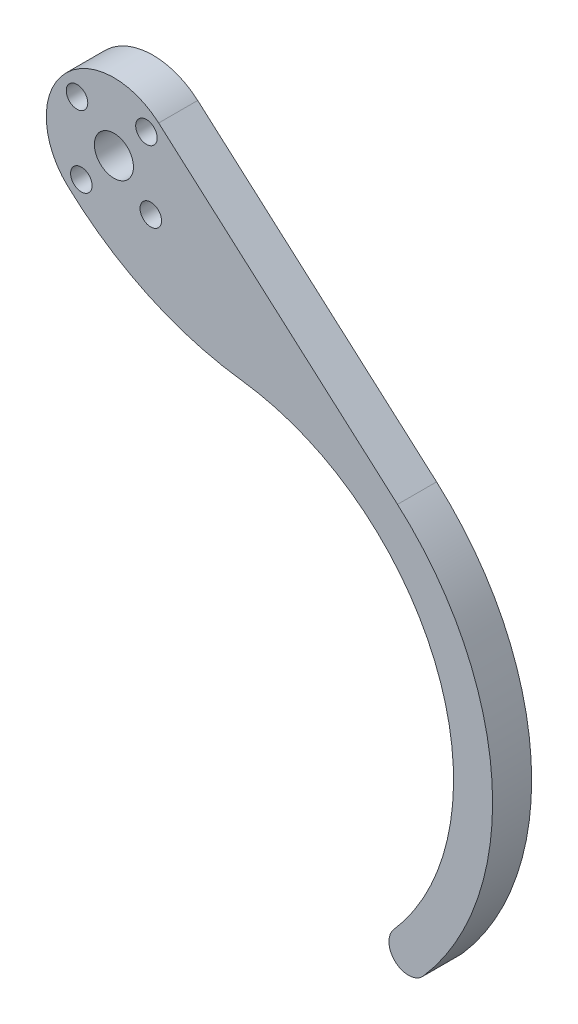
ISO-10303-21;
HEADER;
FILE_DESCRIPTION(('STEP AP214'),'2;1');
FILE_NAME('part.step','',(''),(''),'','','');
FILE_SCHEMA(('AUTOMOTIVE_DESIGN { 1 0 10303 214 1 1 1 1 }'));
ENDSEC;
DATA;
#1=APPLICATION_CONTEXT('core data for automotive mechanical design processes');
#2=APPLICATION_PROTOCOL_DEFINITION('international standard','automotive_design',2000,#1);
#3=PRODUCT_CONTEXT('',#1,'mechanical');
#4=PRODUCT('Part','Part','',(#3));
#5=PRODUCT_RELATED_PRODUCT_CATEGORY('part','',(#4));
#6=PRODUCT_DEFINITION_FORMATION('','',#4);
#7=PRODUCT_DEFINITION_CONTEXT('part definition',#1,'design');
#8=PRODUCT_DEFINITION('design','',#6,#7);
#9=PRODUCT_DEFINITION_SHAPE('','',#8);
#10=(LENGTH_UNIT() NAMED_UNIT(*) SI_UNIT(.MILLI.,.METRE.));
#11=(NAMED_UNIT(*) PLANE_ANGLE_UNIT() SI_UNIT($,.RADIAN.));
#12=(NAMED_UNIT(*) SI_UNIT($,.STERADIAN.) SOLID_ANGLE_UNIT());
#13=UNCERTAINTY_MEASURE_WITH_UNIT(LENGTH_MEASURE(1.E-05),#10,'distance_accuracy_value','');
#14=(GEOMETRIC_REPRESENTATION_CONTEXT(3) GLOBAL_UNCERTAINTY_ASSIGNED_CONTEXT((#13)) GLOBAL_UNIT_ASSIGNED_CONTEXT((#10,
#11,#12)) REPRESENTATION_CONTEXT('',''));
#15=CARTESIAN_POINT('',(0.,0.,0.));
#16=DIRECTION('',(0.,0.,1.));
#17=DIRECTION('',(1.,0.,0.));
#18=AXIS2_PLACEMENT_3D('',#15,#16,#17);
#19=CARTESIAN_POINT('',(11.2309982796719,89.467835436217,6.35));
#20=DIRECTION('',(0.,0.,-1.));
#21=DIRECTION('',(-1.,0.,0.));
#22=AXIS2_PLACEMENT_3D('',#19,#20,#21);
#23=CYLINDRICAL_SURFACE('',#22,50.8);
#24=CARTESIAN_POINT('',(11.2309982796719,89.467835436217,0.));
#25=DIRECTION('',(0.,0.,1.));
#26=DIRECTION('',(1.,0.,0.));
#27=AXIS2_PLACEMENT_3D('',#24,#25,#26);
#28=CIRCLE('',#27,50.8);
#29=CARTESIAN_POINT('',(-23.3666075647334,52.2704474925029,0.));
#30=VERTEX_POINT('',#29);
#31=CARTESIAN_POINT('',(4.90367530520884,39.0634211059539,0.));
#32=VERTEX_POINT('',#31);
#33=EDGE_CURVE('E116',#30,#32,#28,.T.);
#34=ORIENTED_EDGE('',*,*,#33,.T.);
#35=DIRECTION('',(0.,0.,-1.));
#36=VECTOR('',#35,1.);
#37=CARTESIAN_POINT('',(4.90367530520884,39.0634211059539,6.35));
#38=LINE('',#37,#36);
#39=CARTESIAN_POINT('',(4.90367530520884,39.0634211059539,6.35));
#40=VERTEX_POINT('',#39);
#41=EDGE_CURVE('E11',#40,#32,#38,.T.);
#42=ORIENTED_EDGE('',*,*,#41,.F.);
#43=CARTESIAN_POINT('',(11.2309982796719,89.467835436217,6.35));
#44=DIRECTION('',(0.,0.,1.));
#45=DIRECTION('',(1.,0.,0.));
#46=AXIS2_PLACEMENT_3D('',#43,#44,#45);
#47=CIRCLE('',#46,50.8);
#48=CARTESIAN_POINT('',(-23.3666075647334,52.2704474925029,6.35));
#49=VERTEX_POINT('',#48);
#50=EDGE_CURVE('E127',#49,#40,#47,.T.);
#51=ORIENTED_EDGE('',*,*,#50,.F.);
#52=DIRECTION('',(0.,0.,-1.));
#53=VECTOR('',#52,1.);
#54=CARTESIAN_POINT('',(-23.3666075647334,52.2704474925029,6.35));
#55=LINE('',#54,#53);
#56=EDGE_CURVE('E112',#49,#30,#55,.T.);
#57=ORIENTED_EDGE('',*,*,#56,.T.);
#58=EDGE_LOOP('',(#34,#42,#51,#57));
#59=FACE_BOUND('',#58,.T.);
#60=ADVANCED_FACE('F32',(#59),#23,.T.);
#61=CARTESIAN_POINT('',(0.,0.,6.35));
#62=DIRECTION('',(0.,0.,-1.));
#63=DIRECTION('',(-1.,0.,0.));
#64=AXIS2_PLACEMENT_3D('',#61,#62,#63);
#65=CYLINDRICAL_SURFACE('',#64,39.37);
#66=CARTESIAN_POINT('',(0.,0.,0.));
#67=DIRECTION('',(0.,0.,-1.));
#68=DIRECTION('',(1.,0.,0.));
#69=AXIS2_PLACEMENT_3D('',#66,#67,#68);
#70=CIRCLE('',#69,39.37);
#71=CARTESIAN_POINT('',(29.6456856377598,-25.9061811749073,0.));
#72=VERTEX_POINT('',#71);
#73=EDGE_CURVE('E119',#32,#72,#70,.T.);
#74=ORIENTED_EDGE('',*,*,#73,.T.);
#75=DIRECTION('',(0.,0.,-1.));
#76=VECTOR('',#75,1.);
#77=CARTESIAN_POINT('',(29.6456856377598,-25.9061811749073,6.35));
#78=LINE('',#77,#76);
#79=CARTESIAN_POINT('',(29.6456856377598,-25.9061811749073,6.35));
#80=VERTEX_POINT('',#79);
#81=EDGE_CURVE('E40',#80,#72,#78,.T.);
#82=ORIENTED_EDGE('',*,*,#81,.F.);
#83=CARTESIAN_POINT('',(0.,0.,6.35));
#84=DIRECTION('',(0.,0.,-1.));
#85=DIRECTION('',(1.,0.,0.));
#86=AXIS2_PLACEMENT_3D('',#83,#84,#85);
#87=CIRCLE('',#86,39.37);
#88=EDGE_CURVE('E85',#40,#80,#87,.T.);
#89=ORIENTED_EDGE('',*,*,#88,.F.);
#90=ORIENTED_EDGE('',*,*,#41,.T.);
#91=EDGE_LOOP('',(#74,#82,#89,#90));
#92=FACE_BOUND('',#91,.T.);
#93=ADVANCED_FACE('F152',(#92),#65,.F.);
#94=CARTESIAN_POINT('',(32.0364667375792,-27.995389334174,6.35));
#95=DIRECTION('',(0.,0.,-1.));
#96=DIRECTION('',(-1.,0.,0.));
#97=AXIS2_PLACEMENT_3D('',#94,#95,#96);
#98=CYLINDRICAL_SURFACE('',#97,3.175);
#99=CARTESIAN_POINT('',(32.0364667375792,-27.995389334174,0.));
#100=DIRECTION('',(0.,0.,1.));
#101=DIRECTION('',(1.,0.,0.));
#102=AXIS2_PLACEMENT_3D('',#99,#100,#101);
#103=CIRCLE('',#102,3.175);
#104=CARTESIAN_POINT('',(34.4272478373985,-30.0845974934407,0.));
#105=VERTEX_POINT('',#104);
#106=EDGE_CURVE('E122',#72,#105,#103,.T.);
#107=ORIENTED_EDGE('',*,*,#106,.T.);
#108=DIRECTION('',(0.,0.,-1.));
#109=VECTOR('',#108,1.);
#110=CARTESIAN_POINT('',(34.4272478373985,-30.0845974934407,6.35));
#111=LINE('',#110,#109);
#112=CARTESIAN_POINT('',(34.4272478373985,-30.0845974934407,6.35));
#113=VERTEX_POINT('',#112);
#114=EDGE_CURVE('E107',#113,#105,#111,.T.);
#115=ORIENTED_EDGE('',*,*,#114,.F.);
#116=CARTESIAN_POINT('',(32.0364667375792,-27.995389334174,6.35));
#117=DIRECTION('',(0.,0.,1.));
#118=DIRECTION('',(1.,0.,0.));
#119=AXIS2_PLACEMENT_3D('',#116,#117,#118);
#120=CIRCLE('',#119,3.175);
#121=EDGE_CURVE('E98',#80,#113,#120,.T.);
#122=ORIENTED_EDGE('',*,*,#121,.F.);
#123=ORIENTED_EDGE('',*,*,#81,.T.);
#124=EDGE_LOOP('',(#107,#115,#122,#123));
#125=FACE_BOUND('',#124,.T.);
#126=ADVANCED_FACE('F133',(#125),#98,.T.);
#127=CARTESIAN_POINT('',(0.,0.,6.35));
#128=DIRECTION('',(0.,0.,-1.));
#129=DIRECTION('',(-1.,0.,0.));
#130=AXIS2_PLACEMENT_3D('',#127,#128,#129);
#131=CYLINDRICAL_SURFACE('',#130,45.72);
#132=CARTESIAN_POINT('',(0.,0.,0.));
#133=DIRECTION('',(0.,0.,1.));
#134=DIRECTION('',(1.,0.,0.));
#135=AXIS2_PLACEMENT_3D('',#132,#133,#134);
#136=CIRCLE('',#135,45.72);
#137=CARTESIAN_POINT('',(30.2564360895205,34.2763252867159,0.));
#138=VERTEX_POINT('',#137);
#139=EDGE_CURVE('E106',#105,#138,#136,.T.);
#140=ORIENTED_EDGE('',*,*,#139,.T.);
#141=DIRECTION('',(0.,0.,-1.));
#142=VECTOR('',#141,1.);
#143=CARTESIAN_POINT('',(30.2564360895205,34.2763252867159,6.35));
#144=LINE('',#143,#142);
#145=CARTESIAN_POINT('',(30.2564360895205,34.2763252867159,6.35));
#146=VERTEX_POINT('',#145);
#147=EDGE_CURVE('E103',#146,#138,#144,.T.);
#148=ORIENTED_EDGE('',*,*,#147,.F.);
#149=CARTESIAN_POINT('',(0.,0.,6.35));
#150=DIRECTION('',(0.,0.,1.));
#151=DIRECTION('',(1.,0.,0.));
#152=AXIS2_PLACEMENT_3D('',#149,#150,#151);
#153=CIRCLE('',#152,45.72);
#154=EDGE_CURVE('E92',#113,#146,#153,.T.);
#155=ORIENTED_EDGE('',*,*,#154,.F.);
#156=ORIENTED_EDGE('',*,*,#114,.T.);
#157=EDGE_LOOP('',(#140,#148,#155,#156));
#158=FACE_BOUND('',#157,.T.);
#159=ADVANCED_FACE('F104',(#158),#131,.T.);
#160=CARTESIAN_POINT('',(-8.59545500908298,68.5717099333744,6.35));
#161=DIRECTION('',(-0.661776817356092,-0.749700903034031,0.));
#162=DIRECTION('',(0.749700903034031,-0.661776817356092,0.));
#163=AXIS2_PLACEMENT_3D('',#160,#161,#162);
#164=PLANE('',#163);
#165=DIRECTION('',(-0.749700903034031,0.661776817356092,0.));
#166=VECTOR('',#165,1.);
#167=CARTESIAN_POINT('',(-8.59545500908298,68.5717099333744,0.));
#168=LINE('',#167,#166);
#169=CARTESIAN_POINT('',(-8.59545500908298,68.5717099333744,0.));
#170=VERTEX_POINT('',#169);
#171=EDGE_CURVE('E71',#138,#170,#168,.T.);
#172=ORIENTED_EDGE('',*,*,#171,.T.);
#173=DIRECTION('',(0.,0.,-1.));
#174=VECTOR('',#173,1.);
#175=CARTESIAN_POINT('',(-8.59545500908298,68.5717099333744,6.35));
#176=LINE('',#175,#174);
#177=CARTESIAN_POINT('',(-8.59545500908298,68.5717099333744,6.35));
#178=VERTEX_POINT('',#177);
#179=EDGE_CURVE('E108',#178,#170,#176,.T.);
#180=ORIENTED_EDGE('',*,*,#179,.F.);
#181=DIRECTION('',(-0.749700903034031,0.661776817356092,0.));
#182=VECTOR('',#181,1.);
#183=CARTESIAN_POINT('',(-8.59545500908298,68.5717099333744,6.35));
#184=LINE('',#183,#182);
#185=EDGE_CURVE('E96',#146,#178,#184,.T.);
#186=ORIENTED_EDGE('',*,*,#185,.F.);
#187=ORIENTED_EDGE('',*,*,#147,.T.);
#188=EDGE_LOOP('',(#172,#180,#186,#187));
#189=FACE_BOUND('',#188,.T.);
#190=ADVANCED_FACE('F110',(#189),#164,.F.);
#191=CARTESIAN_POINT('',(-15.875,60.325,6.35));
#192=DIRECTION('',(0.,0.,-1.));
#193=DIRECTION('',(-1.,0.,0.));
#194=AXIS2_PLACEMENT_3D('',#191,#192,#193);
#195=CYLINDRICAL_SURFACE('',#194,11.);
#196=CARTESIAN_POINT('',(-15.875,60.325,0.));
#197=DIRECTION('',(0.,0.,1.));
#198=DIRECTION('',(-1.,0.,0.));
#199=AXIS2_PLACEMENT_3D('',#196,#197,#198);
#200=CIRCLE('',#199,11.);
#201=EDGE_CURVE('E77',#170,#30,#200,.T.);
#202=ORIENTED_EDGE('',*,*,#201,.T.);
#203=ORIENTED_EDGE('',*,*,#56,.F.);
#204=CARTESIAN_POINT('',(-15.875,60.325,6.35));
#205=DIRECTION('',(0.,0.,1.));
#206=DIRECTION('',(-1.,0.,0.));
#207=AXIS2_PLACEMENT_3D('',#204,#205,#206);
#208=CIRCLE('',#207,11.);
#209=EDGE_CURVE('E48',#178,#49,#208,.T.);
#210=ORIENTED_EDGE('',*,*,#209,.F.);
#211=ORIENTED_EDGE('',*,*,#179,.T.);
#212=EDGE_LOOP('',(#202,#203,#210,#211));
#213=FACE_BOUND('',#212,.T.);
#214=ADVANCED_FACE('F140',(#213),#195,.T.);
#215=CARTESIAN_POINT('',(11.2309982796719,89.467835436217,6.35));
#216=DIRECTION('',(0.,0.,1.));
#217=DIRECTION('',(1.,0.,0.));
#218=AXIS2_PLACEMENT_3D('',#215,#216,#217);
#219=PLANE('',#218);
#220=CARTESIAN_POINT('',(-21.8726072242722,65.6192145388485,6.35));
#221=DIRECTION('',(0.,0.,1.));
#222=DIRECTION('',(1.,0.,0.));
#223=AXIS2_PLACEMENT_3D('',#220,#221,#222);
#224=CIRCLE('',#223,1.75000000000001);
#225=CARTESIAN_POINT('',(-20.1226072242722,65.6192145388485,6.35));
#226=VERTEX_POINT('',#225);
#227=EDGE_CURVE('E248',#226,#226,#224,.T.);
#228=ORIENTED_EDGE('',*,*,#227,.F.);
#229=EDGE_LOOP('',(#228));
#230=FACE_BOUND('',#229,.T.);
#231=CARTESIAN_POINT('',(-21.1692145388484,54.3273927757275,6.35));
#232=DIRECTION('',(0.,0.,1.));
#233=DIRECTION('',(1.,0.,0.));
#234=AXIS2_PLACEMENT_3D('',#231,#232,#233);
#235=CIRCLE('',#234,1.75);
#236=CARTESIAN_POINT('',(-19.4192145388484,54.3273927757275,6.35));
#237=VERTEX_POINT('',#236);
#238=EDGE_CURVE('E250',#237,#237,#235,.T.);
#239=ORIENTED_EDGE('',*,*,#238,.F.);
#240=EDGE_LOOP('',(#239));
#241=FACE_BOUND('',#240,.T.);
#242=CARTESIAN_POINT('',(-9.87739277572743,55.0307854611513,6.35));
#243=DIRECTION('',(0.,0.,1.));
#244=DIRECTION('',(1.,0.,0.));
#245=AXIS2_PLACEMENT_3D('',#242,#243,#244);
#246=CIRCLE('',#245,1.75);
#247=CARTESIAN_POINT('',(-8.12739277572743,55.0307854611513,6.35));
#248=VERTEX_POINT('',#247);
#249=EDGE_CURVE('E256',#248,#248,#246,.T.);
#250=ORIENTED_EDGE('',*,*,#249,.F.);
#251=EDGE_LOOP('',(#250));
#252=FACE_BOUND('',#251,.T.);
#253=CARTESIAN_POINT('',(-10.5807854611513,66.3226072242723,6.35));
#254=DIRECTION('',(0.,0.,1.));
#255=DIRECTION('',(1.,0.,0.));
#256=AXIS2_PLACEMENT_3D('',#253,#254,#255);
#257=CIRCLE('',#256,1.75);
#258=CARTESIAN_POINT('',(-8.83078546115125,66.3226072242723,6.35));
#259=VERTEX_POINT('',#258);
#260=EDGE_CURVE('E262',#259,#259,#257,.T.);
#261=ORIENTED_EDGE('',*,*,#260,.F.);
#262=EDGE_LOOP('',(#261));
#263=FACE_BOUND('',#262,.T.);
#264=CARTESIAN_POINT('',(-15.875,60.325,6.35));
#265=DIRECTION('',(0.,0.,1.));
#266=DIRECTION('',(1.,0.,0.));
#267=AXIS2_PLACEMENT_3D('',#264,#265,#266);
#268=CIRCLE('',#267,3.175);
#269=CARTESIAN_POINT('',(-12.7,60.325,6.35));
#270=VERTEX_POINT('',#269);
#271=EDGE_CURVE('E268',#270,#270,#268,.T.);
#272=ORIENTED_EDGE('',*,*,#271,.F.);
#273=EDGE_LOOP('',(#272));
#274=FACE_BOUND('',#273,.T.);
#275=ORIENTED_EDGE('',*,*,#50,.T.);
#276=ORIENTED_EDGE('',*,*,#88,.T.);
#277=ORIENTED_EDGE('',*,*,#121,.T.);
#278=ORIENTED_EDGE('',*,*,#154,.T.);
#279=ORIENTED_EDGE('',*,*,#185,.T.);
#280=ORIENTED_EDGE('',*,*,#209,.T.);
#281=EDGE_LOOP('',(#275,#276,#277,#278,#279,#280));
#282=FACE_BOUND('',#281,.T.);
#283=ADVANCED_FACE('F94',(#230,#241,#252,#263,#274,#282),#219,.T.);
#284=CARTESIAN_POINT('',(11.2309982796719,89.467835436217,0.));
#285=DIRECTION('',(0.,0.,1.));
#286=DIRECTION('',(1.,0.,0.));
#287=AXIS2_PLACEMENT_3D('',#284,#285,#286);
#288=PLANE('',#287);
#289=CARTESIAN_POINT('',(-21.8726072242722,65.6192145388485,0.));
#290=DIRECTION('',(0.,0.,1.));
#291=DIRECTION('',(1.,0.,0.));
#292=AXIS2_PLACEMENT_3D('',#289,#290,#291);
#293=CIRCLE('',#292,1.75000000000001);
#294=CARTESIAN_POINT('',(-20.1226072242722,65.6192145388485,0.));
#295=VERTEX_POINT('',#294);
#296=EDGE_CURVE('E245',#295,#295,#293,.T.);
#297=ORIENTED_EDGE('',*,*,#296,.T.);
#298=EDGE_LOOP('',(#297));
#299=FACE_BOUND('',#298,.T.);
#300=CARTESIAN_POINT('',(-21.1692145388484,54.3273927757275,0.));
#301=DIRECTION('',(0.,0.,1.));
#302=DIRECTION('',(1.,0.,0.));
#303=AXIS2_PLACEMENT_3D('',#300,#301,#302);
#304=CIRCLE('',#303,1.75);
#305=CARTESIAN_POINT('',(-19.4192145388484,54.3273927757275,0.));
#306=VERTEX_POINT('',#305);
#307=EDGE_CURVE('E253',#306,#306,#304,.T.);
#308=ORIENTED_EDGE('',*,*,#307,.T.);
#309=EDGE_LOOP('',(#308));
#310=FACE_BOUND('',#309,.T.);
#311=CARTESIAN_POINT('',(-9.87739277572743,55.0307854611513,0.));
#312=DIRECTION('',(0.,0.,1.));
#313=DIRECTION('',(1.,0.,0.));
#314=AXIS2_PLACEMENT_3D('',#311,#312,#313);
#315=CIRCLE('',#314,1.75);
#316=CARTESIAN_POINT('',(-8.12739277572743,55.0307854611513,0.));
#317=VERTEX_POINT('',#316);
#318=EDGE_CURVE('E259',#317,#317,#315,.T.);
#319=ORIENTED_EDGE('',*,*,#318,.T.);
#320=EDGE_LOOP('',(#319));
#321=FACE_BOUND('',#320,.T.);
#322=CARTESIAN_POINT('',(-10.5807854611513,66.3226072242723,0.));
#323=DIRECTION('',(0.,0.,1.));
#324=DIRECTION('',(1.,0.,0.));
#325=AXIS2_PLACEMENT_3D('',#322,#323,#324);
#326=CIRCLE('',#325,1.75);
#327=CARTESIAN_POINT('',(-8.83078546115125,66.3226072242723,0.));
#328=VERTEX_POINT('',#327);
#329=EDGE_CURVE('E265',#328,#328,#326,.T.);
#330=ORIENTED_EDGE('',*,*,#329,.T.);
#331=EDGE_LOOP('',(#330));
#332=FACE_BOUND('',#331,.T.);
#333=CARTESIAN_POINT('',(-15.875,60.325,0.));
#334=DIRECTION('',(0.,0.,1.));
#335=DIRECTION('',(1.,0.,0.));
#336=AXIS2_PLACEMENT_3D('',#333,#334,#335);
#337=CIRCLE('',#336,3.175);
#338=CARTESIAN_POINT('',(-12.7,60.325,0.));
#339=VERTEX_POINT('',#338);
#340=EDGE_CURVE('E120',#339,#339,#337,.T.);
#341=ORIENTED_EDGE('',*,*,#340,.T.);
#342=EDGE_LOOP('',(#341));
#343=FACE_BOUND('',#342,.T.);
#344=ORIENTED_EDGE('',*,*,#33,.F.);
#345=ORIENTED_EDGE('',*,*,#201,.F.);
#346=ORIENTED_EDGE('',*,*,#171,.F.);
#347=ORIENTED_EDGE('',*,*,#139,.F.);
#348=ORIENTED_EDGE('',*,*,#106,.F.);
#349=ORIENTED_EDGE('',*,*,#73,.F.);
#350=EDGE_LOOP('',(#344,#345,#346,#347,#348,#349));
#351=FACE_BOUND('',#350,.T.);
#352=ADVANCED_FACE('F136',(#299,#310,#321,#332,#343,#351),#288,.F.);
#353=CARTESIAN_POINT('',(-15.875,60.325,0.));
#354=DIRECTION('',(0.,0.,1.));
#355=DIRECTION('',(1.,0.,0.));
#356=AXIS2_PLACEMENT_3D('',#353,#354,#355);
#357=CYLINDRICAL_SURFACE('',#356,3.175);
#358=ORIENTED_EDGE('',*,*,#340,.F.);
#359=EDGE_LOOP('',(#358));
#360=FACE_BOUND('',#359,.T.);
#361=ORIENTED_EDGE('',*,*,#271,.T.);
#362=EDGE_LOOP('',(#361));
#363=FACE_BOUND('',#362,.T.);
#364=ADVANCED_FACE('F189',(#360,#363),#357,.F.);
#365=CARTESIAN_POINT('',(-10.5807854611513,66.3226072242723,0.));
#366=DIRECTION('',(0.,0.,1.));
#367=DIRECTION('',(1.,0.,0.));
#368=AXIS2_PLACEMENT_3D('',#365,#366,#367);
#369=CYLINDRICAL_SURFACE('',#368,1.75);
#370=ORIENTED_EDGE('',*,*,#329,.F.);
#371=EDGE_LOOP('',(#370));
#372=FACE_BOUND('',#371,.T.);
#373=ORIENTED_EDGE('',*,*,#260,.T.);
#374=EDGE_LOOP('',(#373));
#375=FACE_BOUND('',#374,.T.);
#376=ADVANCED_FACE('F198',(#372,#375),#369,.F.);
#377=CARTESIAN_POINT('',(-9.87739277572743,55.0307854611513,0.));
#378=DIRECTION('',(0.,0.,1.));
#379=DIRECTION('',(1.,0.,0.));
#380=AXIS2_PLACEMENT_3D('',#377,#378,#379);
#381=CYLINDRICAL_SURFACE('',#380,1.75);
#382=ORIENTED_EDGE('',*,*,#318,.F.);
#383=EDGE_LOOP('',(#382));
#384=FACE_BOUND('',#383,.T.);
#385=ORIENTED_EDGE('',*,*,#249,.T.);
#386=EDGE_LOOP('',(#385));
#387=FACE_BOUND('',#386,.T.);
#388=ADVANCED_FACE('F208',(#384,#387),#381,.F.);
#389=CARTESIAN_POINT('',(-21.1692145388484,54.3273927757275,0.));
#390=DIRECTION('',(0.,0.,1.));
#391=DIRECTION('',(1.,0.,0.));
#392=AXIS2_PLACEMENT_3D('',#389,#390,#391);
#393=CYLINDRICAL_SURFACE('',#392,1.75);
#394=ORIENTED_EDGE('',*,*,#307,.F.);
#395=EDGE_LOOP('',(#394));
#396=FACE_BOUND('',#395,.T.);
#397=ORIENTED_EDGE('',*,*,#238,.T.);
#398=EDGE_LOOP('',(#397));
#399=FACE_BOUND('',#398,.T.);
#400=ADVANCED_FACE('F218',(#396,#399),#393,.F.);
#401=CARTESIAN_POINT('',(-21.8726072242722,65.6192145388485,0.));
#402=DIRECTION('',(0.,0.,1.));
#403=DIRECTION('',(1.,0.,0.));
#404=AXIS2_PLACEMENT_3D('',#401,#402,#403);
#405=CYLINDRICAL_SURFACE('',#404,1.75000000000001);
#406=ORIENTED_EDGE('',*,*,#296,.F.);
#407=EDGE_LOOP('',(#406));
#408=FACE_BOUND('',#407,.T.);
#409=ORIENTED_EDGE('',*,*,#227,.T.);
#410=EDGE_LOOP('',(#409));
#411=FACE_BOUND('',#410,.T.);
#412=ADVANCED_FACE('F228',(#408,#411),#405,.F.);
#413=CLOSED_SHELL('',(#60,#93,#126,#159,#190,#214,#283,#352,#364,#376,#388,#400,#412));
#414=MANIFOLD_SOLID_BREP('B2',#413);
#415=ADVANCED_BREP_SHAPE_REPRESENTATION('',(#18,#414),#14);
#416=SHAPE_DEFINITION_REPRESENTATION(#9,#415);
ENDSEC;
END-ISO-10303-21;
